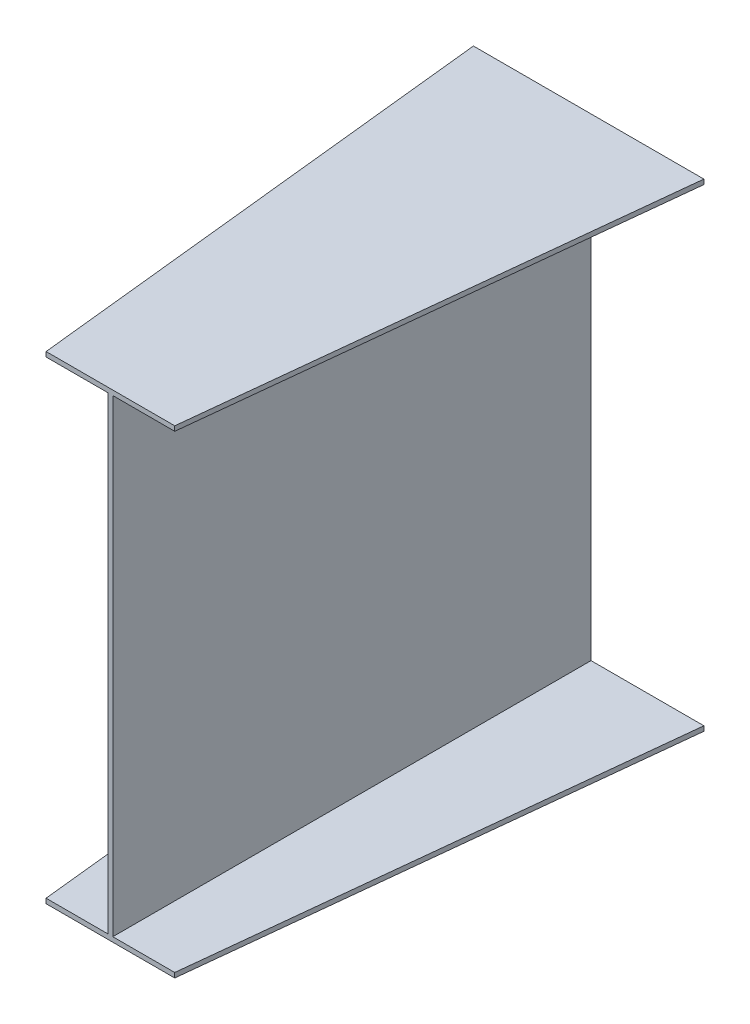
ISO-10303-21;
HEADER;
FILE_DESCRIPTION(('STEP AP214'),'2;1');
FILE_NAME('part.step','',(''),(''),'','','');
FILE_SCHEMA(('AUTOMOTIVE_DESIGN { 1 0 10303 214 1 1 1 1 }'));
ENDSEC;
DATA;
#1=APPLICATION_CONTEXT('core data for automotive mechanical design processes');
#2=APPLICATION_PROTOCOL_DEFINITION('international standard','automotive_design',2000,#1);
#3=PRODUCT_CONTEXT('',#1,'mechanical');
#4=PRODUCT('Part','Part','',(#3));
#5=PRODUCT_RELATED_PRODUCT_CATEGORY('part','',(#4));
#6=PRODUCT_DEFINITION_FORMATION('','',#4);
#7=PRODUCT_DEFINITION_CONTEXT('part definition',#1,'design');
#8=PRODUCT_DEFINITION('design','',#6,#7);
#9=PRODUCT_DEFINITION_SHAPE('','',#8);
#10=(LENGTH_UNIT() NAMED_UNIT(*) SI_UNIT(.MILLI.,.METRE.));
#11=(NAMED_UNIT(*) PLANE_ANGLE_UNIT() SI_UNIT($,.RADIAN.));
#12=(NAMED_UNIT(*) SI_UNIT($,.STERADIAN.) SOLID_ANGLE_UNIT());
#13=UNCERTAINTY_MEASURE_WITH_UNIT(LENGTH_MEASURE(1.E-05),#10,'distance_accuracy_value','');
#14=(GEOMETRIC_REPRESENTATION_CONTEXT(3) GLOBAL_UNCERTAINTY_ASSIGNED_CONTEXT((#13)) GLOBAL_UNIT_ASSIGNED_CONTEXT((#10,
#11,#12)) REPRESENTATION_CONTEXT('',''));
#15=CARTESIAN_POINT('',(0.,0.,0.));
#16=DIRECTION('',(0.,0.,1.));
#17=DIRECTION('',(1.,0.,0.));
#18=AXIS2_PLACEMENT_3D('',#15,#16,#17);
#19=CARTESIAN_POINT('',(0.,0.,1000.));
#20=DIRECTION('',(0.,0.,1.));
#21=DIRECTION('',(1.,0.,0.));
#22=AXIS2_PLACEMENT_3D('',#19,#20,#21);
#23=PLANE('',#22);
#24=DIRECTION('',(-1.,0.,0.));
#25=VECTOR('',#24,1.);
#26=CARTESIAN_POINT('',(-129.5,0.,1000.));
#27=LINE('',#26,#25);
#28=CARTESIAN_POINT('',(0.,0.,1000.));
#29=VERTEX_POINT('',#28);
#30=CARTESIAN_POINT('',(-129.5,0.,1000.));
#31=VERTEX_POINT('',#30);
#32=EDGE_CURVE('E352',#29,#31,#27,.T.);
#33=ORIENTED_EDGE('',*,*,#32,.T.);
#34=DIRECTION('',(0.,-1.,0.));
#35=VECTOR('',#34,1.);
#36=CARTESIAN_POINT('',(-129.5,0.,1000.));
#37=LINE('',#36,#35);
#38=CARTESIAN_POINT('',(-129.5,-10.,1000.));
#39=VERTEX_POINT('',#38);
#40=EDGE_CURVE('E12',#31,#39,#37,.T.);
#41=ORIENTED_EDGE('',*,*,#40,.T.);
#42=DIRECTION('',(1.,0.,0.));
#43=VECTOR('',#42,1.);
#44=CARTESIAN_POINT('',(-129.5,-10.,1000.));
#45=LINE('',#44,#43);
#46=CARTESIAN_POINT('',(139.5,-10.,1000.));
#47=VERTEX_POINT('',#46);
#48=EDGE_CURVE('E76',#39,#47,#45,.T.);
#49=ORIENTED_EDGE('',*,*,#48,.T.);
#50=DIRECTION('',(0.,1.,0.));
#51=VECTOR('',#50,1.);
#52=CARTESIAN_POINT('',(139.5,0.,1000.));
#53=LINE('',#52,#51);
#54=CARTESIAN_POINT('',(139.5,0.,1000.));
#55=VERTEX_POINT('',#54);
#56=EDGE_CURVE('E391',#47,#55,#53,.T.);
#57=ORIENTED_EDGE('',*,*,#56,.T.);
#58=DIRECTION('',(-1.,0.,0.));
#59=VECTOR('',#58,1.);
#60=CARTESIAN_POINT('',(10.,0.,1000.));
#61=LINE('',#60,#59);
#62=CARTESIAN_POINT('',(10.,0.,1000.));
#63=VERTEX_POINT('',#62);
#64=EDGE_CURVE('E409',#55,#63,#61,.T.);
#65=ORIENTED_EDGE('',*,*,#64,.T.);
#66=DIRECTION('',(0.,1.,0.));
#67=VECTOR('',#66,1.);
#68=CARTESIAN_POINT('',(10.,0.,1000.));
#69=LINE('',#68,#67);
#70=CARTESIAN_POINT('',(10.,980.,1000.));
#71=VERTEX_POINT('',#70);
#72=EDGE_CURVE('E413',#63,#71,#69,.T.);
#73=ORIENTED_EDGE('',*,*,#72,.T.);
#74=DIRECTION('',(1.,0.,0.));
#75=VECTOR('',#74,1.);
#76=CARTESIAN_POINT('',(10.,980.,1000.));
#77=LINE('',#76,#75);
#78=CARTESIAN_POINT('',(139.5,980.,1000.));
#79=VERTEX_POINT('',#78);
#80=EDGE_CURVE('E431',#71,#79,#77,.T.);
#81=ORIENTED_EDGE('',*,*,#80,.T.);
#82=DIRECTION('',(0.,1.,0.));
#83=VECTOR('',#82,1.);
#84=CARTESIAN_POINT('',(139.5,990.,1000.));
#85=LINE('',#84,#83);
#86=CARTESIAN_POINT('',(139.5,990.,1000.));
#87=VERTEX_POINT('',#86);
#88=EDGE_CURVE('E435',#79,#87,#85,.T.);
#89=ORIENTED_EDGE('',*,*,#88,.T.);
#90=DIRECTION('',(-1.,0.,0.));
#91=VECTOR('',#90,1.);
#92=CARTESIAN_POINT('',(-129.5,990.,1000.));
#93=LINE('',#92,#91);
#94=CARTESIAN_POINT('',(-129.5,990.,1000.));
#95=VERTEX_POINT('',#94);
#96=EDGE_CURVE('E453',#87,#95,#93,.T.);
#97=ORIENTED_EDGE('',*,*,#96,.T.);
#98=DIRECTION('',(0.,-1.,0.));
#99=VECTOR('',#98,1.);
#100=CARTESIAN_POINT('',(-129.5,990.,1000.));
#101=LINE('',#100,#99);
#102=CARTESIAN_POINT('',(-129.5,980.,1000.));
#103=VERTEX_POINT('',#102);
#104=EDGE_CURVE('E457',#95,#103,#101,.T.);
#105=ORIENTED_EDGE('',*,*,#104,.T.);
#106=DIRECTION('',(1.,0.,0.));
#107=VECTOR('',#106,1.);
#108=CARTESIAN_POINT('',(-129.5,980.,1000.));
#109=LINE('',#108,#107);
#110=CARTESIAN_POINT('',(0.,980.,1000.));
#111=VERTEX_POINT('',#110);
#112=EDGE_CURVE('E367',#103,#111,#109,.T.);
#113=ORIENTED_EDGE('',*,*,#112,.T.);
#114=DIRECTION('',(0.,-1.,0.));
#115=VECTOR('',#114,1.);
#116=CARTESIAN_POINT('',(0.,0.,1000.));
#117=LINE('',#116,#115);
#118=EDGE_CURVE('E307',#111,#29,#117,.T.);
#119=ORIENTED_EDGE('',*,*,#118,.T.);
#120=EDGE_LOOP('',(#33,#41,#49,#57,#65,#73,#81,#89,#97,#105,#113,#119));
#121=FACE_BOUND('',#120,.T.);
#122=ADVANCED_FACE('F65',(#121),#23,.T.);
#123=CARTESIAN_POINT('',(0.,0.,0.));
#124=DIRECTION('',(0.,0.,1.));
#125=DIRECTION('',(1.,0.,0.));
#126=AXIS2_PLACEMENT_3D('',#123,#124,#125);
#127=PLANE('',#126);
#128=DIRECTION('',(-1.,0.,0.));
#129=VECTOR('',#128,1.);
#130=CARTESIAN_POINT('',(-236.,0.,0.));
#131=LINE('',#130,#129);
#132=CARTESIAN_POINT('',(0.,0.,0.));
#133=VERTEX_POINT('',#132);
#134=CARTESIAN_POINT('',(-236.,0.,0.));
#135=VERTEX_POINT('',#134);
#136=EDGE_CURVE('E279',#133,#135,#131,.T.);
#137=ORIENTED_EDGE('',*,*,#136,.F.);
#138=DIRECTION('',(0.,-1.,0.));
#139=VECTOR('',#138,1.);
#140=CARTESIAN_POINT('',(0.,0.,0.));
#141=LINE('',#140,#139);
#142=CARTESIAN_POINT('',(0.,980.,0.));
#143=VERTEX_POINT('',#142);
#144=EDGE_CURVE('E270',#143,#133,#141,.T.);
#145=ORIENTED_EDGE('',*,*,#144,.F.);
#146=DIRECTION('',(1.,0.,0.));
#147=VECTOR('',#146,1.);
#148=CARTESIAN_POINT('',(-236.,980.,0.));
#149=LINE('',#148,#147);
#150=CARTESIAN_POINT('',(-236.,980.,0.));
#151=VERTEX_POINT('',#150);
#152=EDGE_CURVE('E278',#151,#143,#149,.T.);
#153=ORIENTED_EDGE('',*,*,#152,.F.);
#154=DIRECTION('',(0.,-1.,0.));
#155=VECTOR('',#154,1.);
#156=CARTESIAN_POINT('',(-236.,980.,0.));
#157=LINE('',#156,#155);
#158=CARTESIAN_POINT('',(-236.,990.,0.));
#159=VERTEX_POINT('',#158);
#160=EDGE_CURVE('E283',#159,#151,#157,.T.);
#161=ORIENTED_EDGE('',*,*,#160,.F.);
#162=DIRECTION('',(-1.,0.,0.));
#163=VECTOR('',#162,1.);
#164=CARTESIAN_POINT('',(-236.,990.,0.));
#165=LINE('',#164,#163);
#166=CARTESIAN_POINT('',(246.,990.,0.));
#167=VERTEX_POINT('',#166);
#168=EDGE_CURVE('E503',#167,#159,#165,.T.);
#169=ORIENTED_EDGE('',*,*,#168,.F.);
#170=DIRECTION('',(0.,1.,0.));
#171=VECTOR('',#170,1.);
#172=CARTESIAN_POINT('',(246.,980.,0.));
#173=LINE('',#172,#171);
#174=CARTESIAN_POINT('',(246.,980.,0.));
#175=VERTEX_POINT('',#174);
#176=EDGE_CURVE('E743',#175,#167,#173,.T.);
#177=ORIENTED_EDGE('',*,*,#176,.F.);
#178=DIRECTION('',(1.,0.,0.));
#179=VECTOR('',#178,1.);
#180=CARTESIAN_POINT('',(10.,980.,0.));
#181=LINE('',#180,#179);
#182=CARTESIAN_POINT('',(10.,980.,0.));
#183=VERTEX_POINT('',#182);
#184=EDGE_CURVE('E732',#183,#175,#181,.T.);
#185=ORIENTED_EDGE('',*,*,#184,.F.);
#186=DIRECTION('',(0.,1.,0.));
#187=VECTOR('',#186,1.);
#188=CARTESIAN_POINT('',(10.,0.,0.));
#189=LINE('',#188,#187);
#190=CARTESIAN_POINT('',(10.,0.,0.));
#191=VERTEX_POINT('',#190);
#192=EDGE_CURVE('E719',#191,#183,#189,.T.);
#193=ORIENTED_EDGE('',*,*,#192,.F.);
#194=DIRECTION('',(-1.,0.,0.));
#195=VECTOR('',#194,1.);
#196=CARTESIAN_POINT('',(10.,0.,0.));
#197=LINE('',#196,#195);
#198=CARTESIAN_POINT('',(246.,0.,0.));
#199=VERTEX_POINT('',#198);
#200=EDGE_CURVE('E817',#199,#191,#197,.T.);
#201=ORIENTED_EDGE('',*,*,#200,.F.);
#202=DIRECTION('',(0.,1.,0.));
#203=VECTOR('',#202,1.);
#204=CARTESIAN_POINT('',(246.,-10.0000000000001,0.));
#205=LINE('',#204,#203);
#206=CARTESIAN_POINT('',(246.,-10.0000000000001,0.));
#207=VERTEX_POINT('',#206);
#208=EDGE_CURVE('E185',#207,#199,#205,.T.);
#209=ORIENTED_EDGE('',*,*,#208,.F.);
#210=DIRECTION('',(1.,0.,0.));
#211=VECTOR('',#210,1.);
#212=CARTESIAN_POINT('',(-236.,-10.0000000000001,0.));
#213=LINE('',#212,#211);
#214=CARTESIAN_POINT('',(-236.,-10.0000000000001,0.));
#215=VERTEX_POINT('',#214);
#216=EDGE_CURVE('E163',#215,#207,#213,.T.);
#217=ORIENTED_EDGE('',*,*,#216,.F.);
#218=DIRECTION('',(0.,-1.,0.));
#219=VECTOR('',#218,1.);
#220=CARTESIAN_POINT('',(-236.,-10.0000000000001,0.));
#221=LINE('',#220,#219);
#222=EDGE_CURVE('E171',#135,#215,#221,.T.);
#223=ORIENTED_EDGE('',*,*,#222,.F.);
#224=EDGE_LOOP('',(#137,#145,#153,#161,#169,#177,#185,#193,#201,#209,#217,#223));
#225=FACE_BOUND('',#224,.T.);
#226=ADVANCED_FACE('F183',(#225),#127,.F.);
#227=CARTESIAN_POINT('',(0.,980.,0.));
#228=DIRECTION('',(0.,1.,0.));
#229=DIRECTION('',(0.,0.,1.));
#230=AXIS2_PLACEMENT_3D('',#227,#228,#229);
#231=PLANE('',#230);
#232=DIRECTION('',(-0.105901114927492,0.,0.99437666598584));
#233=VECTOR('',#232,1.);
#234=CARTESIAN_POINT('',(246.,980.,0.));
#235=LINE('',#234,#233);
#236=EDGE_CURVE('E178',#175,#79,#235,.T.);
#237=ORIENTED_EDGE('',*,*,#236,.T.);
#238=ORIENTED_EDGE('',*,*,#80,.F.);
#239=DIRECTION('',(0.,0.,1.));
#240=VECTOR('',#239,1.);
#241=CARTESIAN_POINT('',(10.,980.,0.));
#242=LINE('',#241,#240);
#243=EDGE_CURVE('E572',#183,#71,#242,.T.);
#244=ORIENTED_EDGE('',*,*,#243,.F.);
#245=ORIENTED_EDGE('',*,*,#184,.T.);
#246=EDGE_LOOP('',(#237,#238,#244,#245));
#247=FACE_BOUND('',#246,.T.);
#248=ADVANCED_FACE('F205',(#247),#231,.F.);
#249=CARTESIAN_POINT('',(10.,0.,0.));
#250=DIRECTION('',(-1.,0.,0.));
#251=DIRECTION('',(0.,0.,1.));
#252=AXIS2_PLACEMENT_3D('',#249,#250,#251);
#253=PLANE('',#252);
#254=ORIENTED_EDGE('',*,*,#243,.T.);
#255=ORIENTED_EDGE('',*,*,#72,.F.);
#256=DIRECTION('',(0.,0.,1.));
#257=VECTOR('',#256,1.);
#258=CARTESIAN_POINT('',(10.,0.,0.));
#259=LINE('',#258,#257);
#260=EDGE_CURVE('E363',#191,#63,#259,.T.);
#261=ORIENTED_EDGE('',*,*,#260,.F.);
#262=ORIENTED_EDGE('',*,*,#192,.T.);
#263=EDGE_LOOP('',(#254,#255,#261,#262));
#264=FACE_BOUND('',#263,.T.);
#265=ADVANCED_FACE('F554',(#264),#253,.F.);
#266=CARTESIAN_POINT('',(243.24109864885,0.,25.9051770061025));
#267=DIRECTION('',(-0.99437666598584,0.,-0.105901114927492));
#268=DIRECTION('',(-0.105901114927492,0.,0.99437666598584));
#269=AXIS2_PLACEMENT_3D('',#266,#267,#268);
#270=PLANE('',#269);
#271=DIRECTION('',(-0.105901114927492,0.,0.99437666598584));
#272=VECTOR('',#271,1.);
#273=CARTESIAN_POINT('',(246.,990.,0.));
#274=LINE('',#273,#272);
#275=EDGE_CURVE('E564',#167,#87,#274,.T.);
#276=ORIENTED_EDGE('',*,*,#275,.T.);
#277=ORIENTED_EDGE('',*,*,#88,.F.);
#278=ORIENTED_EDGE('',*,*,#236,.F.);
#279=ORIENTED_EDGE('',*,*,#176,.T.);
#280=EDGE_LOOP('',(#276,#277,#278,#279));
#281=FACE_BOUND('',#280,.T.);
#282=ADVANCED_FACE('F546',(#281),#270,.F.);
#283=CARTESIAN_POINT('',(0.,990.,0.));
#284=DIRECTION('',(0.,-1.,0.));
#285=DIRECTION('',(0.,0.,-1.));
#286=AXIS2_PLACEMENT_3D('',#283,#284,#285);
#287=PLANE('',#286);
#288=DIRECTION('',(0.105901114927492,0.,0.99437666598584));
#289=VECTOR('',#288,1.);
#290=CARTESIAN_POINT('',(-236.,990.,0.));
#291=LINE('',#290,#289);
#292=EDGE_CURVE('E315',#159,#95,#291,.T.);
#293=ORIENTED_EDGE('',*,*,#292,.T.);
#294=ORIENTED_EDGE('',*,*,#96,.F.);
#295=ORIENTED_EDGE('',*,*,#275,.F.);
#296=ORIENTED_EDGE('',*,*,#168,.T.);
#297=EDGE_LOOP('',(#293,#294,#295,#296));
#298=FACE_BOUND('',#297,.T.);
#299=ADVANCED_FACE('F518',(#298),#287,.F.);
#300=CARTESIAN_POINT('',(-233.353249110279,0.,24.8521210302447));
#301=DIRECTION('',(0.99437666598584,0.,-0.105901114927492));
#302=DIRECTION('',(-0.105901114927492,0.,-0.99437666598584));
#303=AXIS2_PLACEMENT_3D('',#300,#301,#302);
#304=PLANE('',#303);
#305=DIRECTION('',(0.105901114927492,0.,0.99437666598584));
#306=VECTOR('',#305,1.);
#307=CARTESIAN_POINT('',(-236.,980.,0.));
#308=LINE('',#307,#306);
#309=EDGE_CURVE('E298',#151,#103,#308,.T.);
#310=ORIENTED_EDGE('',*,*,#309,.T.);
#311=ORIENTED_EDGE('',*,*,#104,.F.);
#312=ORIENTED_EDGE('',*,*,#292,.F.);
#313=ORIENTED_EDGE('',*,*,#160,.T.);
#314=EDGE_LOOP('',(#310,#311,#312,#313));
#315=FACE_BOUND('',#314,.T.);
#316=ADVANCED_FACE('F497',(#315),#304,.F.);
#317=CARTESIAN_POINT('',(0.,980.,0.));
#318=DIRECTION('',(0.,1.,0.));
#319=DIRECTION('',(0.,0.,1.));
#320=AXIS2_PLACEMENT_3D('',#317,#318,#319);
#321=PLANE('',#320);
#322=DIRECTION('',(0.,0.,1.));
#323=VECTOR('',#322,1.);
#324=CARTESIAN_POINT('',(0.,980.,0.));
#325=LINE('',#324,#323);
#326=EDGE_CURVE('E296',#143,#111,#325,.T.);
#327=ORIENTED_EDGE('',*,*,#326,.T.);
#328=ORIENTED_EDGE('',*,*,#112,.F.);
#329=ORIENTED_EDGE('',*,*,#309,.F.);
#330=ORIENTED_EDGE('',*,*,#152,.T.);
#331=EDGE_LOOP('',(#327,#328,#329,#330));
#332=FACE_BOUND('',#331,.T.);
#333=ADVANCED_FACE('F294',(#332),#321,.F.);
#334=CARTESIAN_POINT('',(0.,0.,0.));
#335=DIRECTION('',(1.,0.,0.));
#336=DIRECTION('',(0.,0.,-1.));
#337=AXIS2_PLACEMENT_3D('',#334,#335,#336);
#338=PLANE('',#337);
#339=DIRECTION('',(0.,0.,1.));
#340=VECTOR('',#339,1.);
#341=CARTESIAN_POINT('',(0.,0.,0.));
#342=LINE('',#341,#340);
#343=EDGE_CURVE('E310',#133,#29,#342,.T.);
#344=ORIENTED_EDGE('',*,*,#343,.T.);
#345=ORIENTED_EDGE('',*,*,#118,.F.);
#346=ORIENTED_EDGE('',*,*,#326,.F.);
#347=ORIENTED_EDGE('',*,*,#144,.T.);
#348=EDGE_LOOP('',(#344,#345,#346,#347));
#349=FACE_BOUND('',#348,.T.);
#350=ADVANCED_FACE('F304',(#349),#338,.F.);
#351=CARTESIAN_POINT('',(0.,0.,0.));
#352=DIRECTION('',(0.,-1.,0.));
#353=DIRECTION('',(0.,0.,-1.));
#354=AXIS2_PLACEMENT_3D('',#351,#352,#353);
#355=PLANE('',#354);
#356=DIRECTION('',(0.105901114927492,0.,0.99437666598584));
#357=VECTOR('',#356,1.);
#358=CARTESIAN_POINT('',(-236.,0.,0.));
#359=LINE('',#358,#357);
#360=EDGE_CURVE('E84',#135,#31,#359,.T.);
#361=ORIENTED_EDGE('',*,*,#360,.T.);
#362=ORIENTED_EDGE('',*,*,#32,.F.);
#363=ORIENTED_EDGE('',*,*,#343,.F.);
#364=ORIENTED_EDGE('',*,*,#136,.T.);
#365=EDGE_LOOP('',(#361,#362,#363,#364));
#366=FACE_BOUND('',#365,.T.);
#367=ADVANCED_FACE('F335',(#366),#355,.F.);
#368=CARTESIAN_POINT('',(-233.353249110279,0.,24.8521210302447));
#369=DIRECTION('',(0.99437666598584,0.,-0.105901114927492));
#370=DIRECTION('',(-0.105901114927492,0.,-0.99437666598584));
#371=AXIS2_PLACEMENT_3D('',#368,#369,#370);
#372=PLANE('',#371);
#373=DIRECTION('',(0.105901114927492,0.,0.99437666598584));
#374=VECTOR('',#373,1.);
#375=CARTESIAN_POINT('',(-236.,-10.0000000000001,0.));
#376=LINE('',#375,#374);
#377=EDGE_CURVE('E158',#215,#39,#376,.T.);
#378=ORIENTED_EDGE('',*,*,#377,.T.);
#379=ORIENTED_EDGE('',*,*,#40,.F.);
#380=ORIENTED_EDGE('',*,*,#360,.F.);
#381=ORIENTED_EDGE('',*,*,#222,.T.);
#382=EDGE_LOOP('',(#378,#379,#380,#381));
#383=FACE_BOUND('',#382,.T.);
#384=ADVANCED_FACE('F173',(#383),#372,.F.);
#385=CARTESIAN_POINT('',(0.,-10.0000000000001,0.));
#386=DIRECTION('',(0.,1.,0.));
#387=DIRECTION('',(0.,0.,1.));
#388=AXIS2_PLACEMENT_3D('',#385,#386,#387);
#389=PLANE('',#388);
#390=DIRECTION('',(-0.105901114927492,0.,0.99437666598584));
#391=VECTOR('',#390,1.);
#392=CARTESIAN_POINT('',(246.,-10.0000000000001,0.));
#393=LINE('',#392,#391);
#394=EDGE_CURVE('E169',#207,#47,#393,.T.);
#395=ORIENTED_EDGE('',*,*,#394,.T.);
#396=ORIENTED_EDGE('',*,*,#48,.F.);
#397=ORIENTED_EDGE('',*,*,#377,.F.);
#398=ORIENTED_EDGE('',*,*,#216,.T.);
#399=EDGE_LOOP('',(#395,#396,#397,#398));
#400=FACE_BOUND('',#399,.T.);
#401=ADVANCED_FACE('F161',(#400),#389,.F.);
#402=CARTESIAN_POINT('',(243.24109864885,0.,25.9051770061025));
#403=DIRECTION('',(-0.99437666598584,0.,-0.105901114927492));
#404=DIRECTION('',(-0.105901114927492,0.,0.99437666598584));
#405=AXIS2_PLACEMENT_3D('',#402,#403,#404);
#406=PLANE('',#405);
#407=DIRECTION('',(-0.105901114927492,0.,0.99437666598584));
#408=VECTOR('',#407,1.);
#409=CARTESIAN_POINT('',(246.,0.,0.));
#410=LINE('',#409,#408);
#411=EDGE_CURVE('E370',#199,#55,#410,.T.);
#412=ORIENTED_EDGE('',*,*,#411,.T.);
#413=ORIENTED_EDGE('',*,*,#56,.F.);
#414=ORIENTED_EDGE('',*,*,#394,.F.);
#415=ORIENTED_EDGE('',*,*,#208,.T.);
#416=EDGE_LOOP('',(#412,#413,#414,#415));
#417=FACE_BOUND('',#416,.T.);
#418=ADVANCED_FACE('F656',(#417),#406,.F.);
#419=CARTESIAN_POINT('',(0.,0.,0.));
#420=DIRECTION('',(0.,-1.,0.));
#421=DIRECTION('',(0.,0.,-1.));
#422=AXIS2_PLACEMENT_3D('',#419,#420,#421);
#423=PLANE('',#422);
#424=ORIENTED_EDGE('',*,*,#260,.T.);
#425=ORIENTED_EDGE('',*,*,#64,.F.);
#426=ORIENTED_EDGE('',*,*,#411,.F.);
#427=ORIENTED_EDGE('',*,*,#200,.T.);
#428=EDGE_LOOP('',(#424,#425,#426,#427));
#429=FACE_BOUND('',#428,.T.);
#430=ADVANCED_FACE('F665',(#429),#423,.F.);
#431=CLOSED_SHELL('',(#122,#226,#248,#265,#282,#299,#316,#333,#350,#367,#384,#401,#418,#430));
#432=MANIFOLD_SOLID_BREP('B2',#431);
#433=ADVANCED_BREP_SHAPE_REPRESENTATION('',(#18,#432),#14);
#434=SHAPE_DEFINITION_REPRESENTATION(#9,#433);
ENDSEC;
END-ISO-10303-21;
